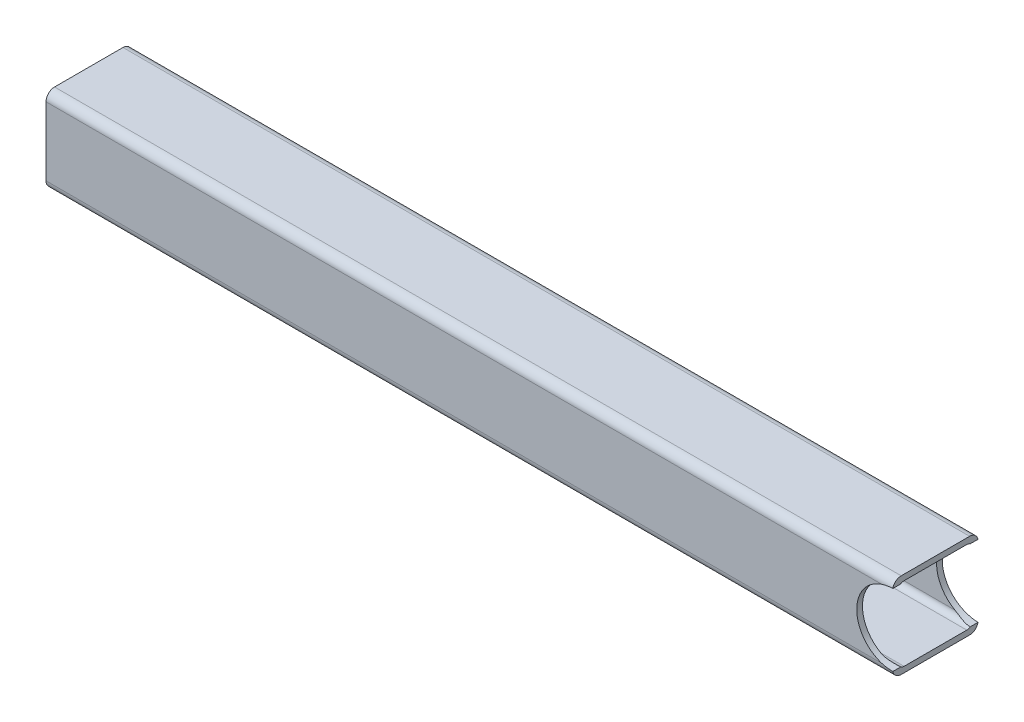
ISO-10303-21;
HEADER;
FILE_DESCRIPTION(('STEP AP214'),'2;1');
FILE_NAME('part.step','',(''),(''),'','','');
FILE_SCHEMA(('AUTOMOTIVE_DESIGN { 1 0 10303 214 1 1 1 1 }'));
ENDSEC;
DATA;
#1=APPLICATION_CONTEXT('core data for automotive mechanical design processes');
#2=APPLICATION_PROTOCOL_DEFINITION('international standard','automotive_design',2000,#1);
#3=PRODUCT_CONTEXT('',#1,'mechanical');
#4=PRODUCT('Part','Part','',(#3));
#5=PRODUCT_RELATED_PRODUCT_CATEGORY('part','',(#4));
#6=PRODUCT_DEFINITION_FORMATION('','',#4);
#7=PRODUCT_DEFINITION_CONTEXT('part definition',#1,'design');
#8=PRODUCT_DEFINITION('design','',#6,#7);
#9=PRODUCT_DEFINITION_SHAPE('','',#8);
#10=(LENGTH_UNIT() NAMED_UNIT(*) SI_UNIT(.MILLI.,.METRE.));
#11=(NAMED_UNIT(*) PLANE_ANGLE_UNIT() SI_UNIT($,.RADIAN.));
#12=(NAMED_UNIT(*) SI_UNIT($,.STERADIAN.) SOLID_ANGLE_UNIT());
#13=UNCERTAINTY_MEASURE_WITH_UNIT(LENGTH_MEASURE(1.E-05),#10,'distance_accuracy_value','');
#14=(GEOMETRIC_REPRESENTATION_CONTEXT(3) GLOBAL_UNCERTAINTY_ASSIGNED_CONTEXT((#13)) GLOBAL_UNIT_ASSIGNED_CONTEXT((#10,
#11,#12)) REPRESENTATION_CONTEXT('',''));
#15=CARTESIAN_POINT('',(0.,0.,0.));
#16=DIRECTION('',(0.,0.,1.));
#17=DIRECTION('',(1.,0.,0.));
#18=AXIS2_PLACEMENT_3D('',#15,#16,#17);
#19=CARTESIAN_POINT('',(0.,-12.,12.));
#20=DIRECTION('',(1.,0.,0.));
#21=DIRECTION('',(0.,0.,-1.));
#22=AXIS2_PLACEMENT_3D('',#19,#20,#21);
#23=PLANE('',#22);
#24=DIRECTION('',(0.,0.,1.));
#25=VECTOR('',#24,1.);
#26=CARTESIAN_POINT('',(0.,12.6,-15.));
#27=LINE('',#26,#25);
#28=CARTESIAN_POINT('',(0.,12.6,-14.9393876913398));
#29=VERTEX_POINT('',#28);
#30=CARTESIAN_POINT('',(0.,12.6,-12.2));
#31=VERTEX_POINT('',#30);
#32=EDGE_CURVE('E57',#29,#31,#27,.T.);
#33=ORIENTED_EDGE('',*,*,#32,.F.);
#34=CARTESIAN_POINT('',(0.,12.,-12.));
#35=DIRECTION('',(1.,0.,0.));
#36=DIRECTION('',(0.,0.,1.));
#37=AXIS2_PLACEMENT_3D('',#34,#35,#36);
#38=CIRCLE('',#37,3.);
#39=CARTESIAN_POINT('',(0.,15.,-12.));
#40=VERTEX_POINT('',#39);
#41=EDGE_CURVE('E196',#29,#40,#38,.T.);
#42=ORIENTED_EDGE('',*,*,#41,.T.);
#43=DIRECTION('',(0.,0.,1.));
#44=VECTOR('',#43,1.);
#45=CARTESIAN_POINT('',(0.,15.,12.));
#46=LINE('',#45,#44);
#47=CARTESIAN_POINT('',(0.,15.,12.));
#48=VERTEX_POINT('',#47);
#49=EDGE_CURVE('E241',#40,#48,#46,.T.);
#50=ORIENTED_EDGE('',*,*,#49,.T.);
#51=CARTESIAN_POINT('',(0.,12.,12.));
#52=DIRECTION('',(1.,0.,0.));
#53=DIRECTION('',(0.,0.,-1.));
#54=AXIS2_PLACEMENT_3D('',#51,#52,#53);
#55=CIRCLE('',#54,3.);
#56=CARTESIAN_POINT('',(0.,12.6,14.9393876913398));
#57=VERTEX_POINT('',#56);
#58=EDGE_CURVE('E213',#48,#57,#55,.T.);
#59=ORIENTED_EDGE('',*,*,#58,.T.);
#60=CARTESIAN_POINT('',(0.,12.6,12.2));
#61=VERTEX_POINT('',#60);
#62=EDGE_CURVE('E448',#61,#57,#27,.T.);
#63=ORIENTED_EDGE('',*,*,#62,.F.);
#64=CARTESIAN_POINT('',(0.,11.,11.));
#65=DIRECTION('',(1.,0.,0.));
#66=DIRECTION('',(0.,0.,-1.));
#67=AXIS2_PLACEMENT_3D('',#64,#65,#66);
#68=CIRCLE('',#67,2.);
#69=CARTESIAN_POINT('',(0.,13.,11.));
#70=VERTEX_POINT('',#69);
#71=EDGE_CURVE('E265',#70,#61,#68,.T.);
#72=ORIENTED_EDGE('',*,*,#71,.F.);
#73=DIRECTION('',(0.,0.,1.));
#74=VECTOR('',#73,1.);
#75=CARTESIAN_POINT('',(0.,13.,11.));
#76=LINE('',#75,#74);
#77=CARTESIAN_POINT('',(0.,13.,-11.));
#78=VERTEX_POINT('',#77);
#79=EDGE_CURVE('E285',#78,#70,#76,.T.);
#80=ORIENTED_EDGE('',*,*,#79,.F.);
#81=CARTESIAN_POINT('',(0.,11.,-11.));
#82=DIRECTION('',(1.,0.,0.));
#83=DIRECTION('',(0.,0.,1.));
#84=AXIS2_PLACEMENT_3D('',#81,#82,#83);
#85=CIRCLE('',#84,2.);
#86=EDGE_CURVE('E288',#31,#78,#85,.T.);
#87=ORIENTED_EDGE('',*,*,#86,.F.);
#88=EDGE_LOOP('',(#33,#42,#50,#59,#63,#72,#80,#87));
#89=FACE_BOUND('',#88,.T.);
#90=ADVANCED_FACE('F35',(#89),#23,.T.);
#91=CARTESIAN_POINT('',(-519.443177942439,-15.,12.));
#92=DIRECTION('',(0.,-1.,0.));
#93=DIRECTION('',(0.,0.,-1.));
#94=AXIS2_PLACEMENT_3D('',#91,#92,#93);
#95=PLANE('',#94);
#96=DIRECTION('',(0.,0.,1.));
#97=VECTOR('',#96,1.);
#98=CARTESIAN_POINT('',(-297.016771071246,-15.,12.));
#99=LINE('',#98,#97);
#100=CARTESIAN_POINT('',(-297.016771071246,-15.,-12.));
#101=VERTEX_POINT('',#100);
#102=CARTESIAN_POINT('',(-297.016771071246,-15.,12.));
#103=VERTEX_POINT('',#102);
#104=EDGE_CURVE('E50',#101,#103,#99,.T.);
#105=ORIENTED_EDGE('',*,*,#104,.F.);
#106=DIRECTION('',(1.,0.,0.));
#107=VECTOR('',#106,1.);
#108=CARTESIAN_POINT('',(-519.443177942439,-15.,-12.));
#109=LINE('',#108,#107);
#110=CARTESIAN_POINT('',(0.,-15.,-12.));
#111=VERTEX_POINT('',#110);
#112=EDGE_CURVE('E206',#101,#111,#109,.T.);
#113=ORIENTED_EDGE('',*,*,#112,.T.);
#114=DIRECTION('',(0.,0.,-1.));
#115=VECTOR('',#114,1.);
#116=CARTESIAN_POINT('',(0.,-15.,12.));
#117=LINE('',#116,#115);
#118=CARTESIAN_POINT('',(0.,-15.,12.));
#119=VERTEX_POINT('',#118);
#120=EDGE_CURVE('E256',#119,#111,#117,.T.);
#121=ORIENTED_EDGE('',*,*,#120,.F.);
#122=DIRECTION('',(1.,0.,0.));
#123=VECTOR('',#122,1.);
#124=CARTESIAN_POINT('',(-519.443177942439,-15.,12.));
#125=LINE('',#124,#123);
#126=EDGE_CURVE('E211',#103,#119,#125,.T.);
#127=ORIENTED_EDGE('',*,*,#126,.F.);
#128=EDGE_LOOP('',(#105,#113,#121,#127));
#129=FACE_BOUND('',#128,.T.);
#130=ADVANCED_FACE('F427',(#129),#95,.T.);
#131=CARTESIAN_POINT('',(-519.443177942439,-12.,-12.));
#132=DIRECTION('',(1.,0.,0.));
#133=DIRECTION('',(0.,0.,-1.));
#134=AXIS2_PLACEMENT_3D('',#131,#132,#133);
#135=CYLINDRICAL_SURFACE('',#134,3.);
#136=CARTESIAN_POINT('',(0.,-12.6,-14.9393876913398));
#137=CARTESIAN_POINT('',(-0.163187052786457,-12.6000019270772,-14.9393645936936));
#138=CARTESIAN_POINT('',(-0.326372810103336,-12.5968298384955,-14.9400340608083));
#139=CARTESIAN_POINT('',(-0.652481961012394,-12.5841519401844,-14.9425913769675));
#140=CARTESIAN_POINT('',(-0.815405365260419,-12.5746463945522,-14.9444791752089));
#141=CARTESIAN_POINT('',(-1.13977321467515,-12.5493914501626,-14.9492920323616));
#142=CARTESIAN_POINT('',(-1.30122068438478,-12.5336796401389,-14.9522108358541));
#143=CARTESIAN_POINT('',(-1.62337581019444,-12.4960374046838,-14.9587690159304));
#144=CARTESIAN_POINT('',(-1.78408345720283,-12.4741069030376,-14.9624084013452));
#145=CARTESIAN_POINT('',(-2.10451800882307,-12.4240612753338,-14.9699852069209));
#146=CARTESIAN_POINT('',(-2.26424495812741,-12.3959464332928,-14.9739226133898));
#147=CARTESIAN_POINT('',(-2.58249757231617,-12.3335720990921,-14.9815624811371));
#148=CARTESIAN_POINT('',(-2.74102325582698,-12.2993127024118,-14.9852649460652));
#149=CARTESIAN_POINT('',(-3.05760409848083,-12.2244700749938,-14.9918289754535));
#150=CARTESIAN_POINT('',(-3.21565066668061,-12.1838499831871,-14.9946853385464));
#151=CARTESIAN_POINT('',(-3.53007603864369,-12.096495385419,-14.9987616221845));
#152=CARTESIAN_POINT('',(-3.68645473241013,-12.0497604788473,-14.9999814354526));
#153=CARTESIAN_POINT('',(-3.84187454245972,-12.,-15.));
#154=B_SPLINE_CURVE_WITH_KNOTS('',3,(#136,#137,#138,#139,#140,#141,#142,#143,#144,#145,#146,
#147,#148,#149,#150,#151,#152,#153),.UNSPECIFIED.,.F.,.F.,(4,2,2,2,2,2,2,2,4),(0.,
0.489526939852249,0.97903346831559,1.46561963366495,1.95221176275915,2.43878154971315,
2.92534377658904,3.41483783773301,3.90436398399623),.UNSPECIFIED.);
#155=CARTESIAN_POINT('',(0.,-12.6,-14.9393876913398));
#156=VERTEX_POINT('',#155);
#157=CARTESIAN_POINT('',(-3.84187454245972,-12.,-15.));
#158=VERTEX_POINT('',#157);
#159=EDGE_CURVE('E181',#156,#158,#154,.T.);
#160=ORIENTED_EDGE('',*,*,#159,.F.);
#161=CARTESIAN_POINT('',(0.,-12.,-12.));
#162=DIRECTION('',(1.,0.,0.));
#163=DIRECTION('',(0.,0.,-1.));
#164=AXIS2_PLACEMENT_3D('',#161,#162,#163);
#165=CIRCLE('',#164,3.);
#166=EDGE_CURVE('E251',#111,#156,#165,.T.);
#167=ORIENTED_EDGE('',*,*,#166,.F.);
#168=ORIENTED_EDGE('',*,*,#112,.F.);
#169=CARTESIAN_POINT('',(-297.016771071246,-12.,-12.));
#170=DIRECTION('',(1.,0.,0.));
#171=DIRECTION('',(0.,1.,0.));
#172=AXIS2_PLACEMENT_3D('',#169,#170,#171);
#173=CIRCLE('',#172,3.);
#174=CARTESIAN_POINT('',(-297.016771071246,-12.,-15.));
#175=VERTEX_POINT('',#174);
#176=EDGE_CURVE('E216',#175,#101,#173,.F.);
#177=ORIENTED_EDGE('',*,*,#176,.F.);
#178=DIRECTION('',(1.,0.,0.));
#179=VECTOR('',#178,1.);
#180=CARTESIAN_POINT('',(-519.443177942439,-12.,-15.));
#181=LINE('',#180,#179);
#182=EDGE_CURVE('E202',#175,#158,#181,.T.);
#183=ORIENTED_EDGE('',*,*,#182,.T.);
#184=EDGE_LOOP('',(#160,#167,#168,#177,#183));
#185=FACE_BOUND('',#184,.T.);
#186=ADVANCED_FACE('F341',(#185),#135,.T.);
#187=CARTESIAN_POINT('',(-519.443177942439,12.,-15.));
#188=DIRECTION('',(0.,0.,-1.));
#189=DIRECTION('',(0.,1.,0.));
#190=AXIS2_PLACEMENT_3D('',#187,#188,#189);
#191=PLANE('',#190);
#192=CARTESIAN_POINT('',(0.,0.,-15.));
#193=DIRECTION('',(0.,0.,1.));
#194=DIRECTION('',(1.,0.,0.));
#195=AXIS2_PLACEMENT_3D('',#192,#193,#194);
#196=CIRCLE('',#195,12.6);
#197=CARTESIAN_POINT('',(-3.84187454245972,12.,-15.));
#198=VERTEX_POINT('',#197);
#199=EDGE_CURVE('E176',#198,#158,#196,.T.);
#200=ORIENTED_EDGE('',*,*,#199,.T.);
#201=ORIENTED_EDGE('',*,*,#182,.F.);
#202=DIRECTION('',(0.,-1.,0.));
#203=VECTOR('',#202,1.);
#204=CARTESIAN_POINT('',(-297.016771071246,12.,-15.));
#205=LINE('',#204,#203);
#206=CARTESIAN_POINT('',(-297.016771071246,12.,-15.));
#207=VERTEX_POINT('',#206);
#208=EDGE_CURVE('E200',#207,#175,#205,.T.);
#209=ORIENTED_EDGE('',*,*,#208,.F.);
#210=DIRECTION('',(1.,0.,0.));
#211=VECTOR('',#210,1.);
#212=CARTESIAN_POINT('',(-519.443177942439,12.,-15.));
#213=LINE('',#212,#211);
#214=EDGE_CURVE('E194',#207,#198,#213,.T.);
#215=ORIENTED_EDGE('',*,*,#214,.T.);
#216=EDGE_LOOP('',(#200,#201,#209,#215));
#217=FACE_BOUND('',#216,.T.);
#218=ADVANCED_FACE('F199',(#217),#191,.T.);
#219=CARTESIAN_POINT('',(-519.443177942439,12.,-12.));
#220=DIRECTION('',(1.,0.,0.));
#221=DIRECTION('',(0.,0.,-1.));
#222=AXIS2_PLACEMENT_3D('',#219,#220,#221);
#223=CYLINDRICAL_SURFACE('',#222,3.);
#224=CARTESIAN_POINT('',(-3.84187454245972,12.,-15.));
#225=CARTESIAN_POINT('',(-3.68645473241013,12.0497604788473,-14.9999814354526));
#226=CARTESIAN_POINT('',(-3.53007603864368,12.096495385419,-14.9987616221845));
#227=CARTESIAN_POINT('',(-3.21565066668061,12.1838499831871,-14.9946853385464));
#228=CARTESIAN_POINT('',(-3.05760409848083,12.2244700749938,-14.9918289754535));
#229=CARTESIAN_POINT('',(-2.74102325582698,12.2993127024118,-14.9852649460652));
#230=CARTESIAN_POINT('',(-2.58249757231617,12.3335720990921,-14.9815624811371));
#231=CARTESIAN_POINT('',(-2.26424495812741,12.3959464332928,-14.9739226133898));
#232=CARTESIAN_POINT('',(-2.10451800882306,12.4240612753338,-14.9699852069209));
#233=CARTESIAN_POINT('',(-1.78408345720283,12.4741069030376,-14.9624084013452));
#234=CARTESIAN_POINT('',(-1.62337581019444,12.4960374046838,-14.9587690159303));
#235=CARTESIAN_POINT('',(-1.30122068438478,12.5336796401389,-14.9522108358541));
#236=CARTESIAN_POINT('',(-1.13977321467515,12.5493914501626,-14.9492920323616));
#237=CARTESIAN_POINT('',(-0.815405365260419,12.5746463945522,-14.9444791752089));
#238=CARTESIAN_POINT('',(-0.652481961012394,12.5841519401844,-14.9425913769675));
#239=CARTESIAN_POINT('',(-0.326372810103336,12.5968298384955,-14.9400340608083));
#240=CARTESIAN_POINT('',(-0.163187052786456,12.6000019270772,-14.9393645936936));
#241=CARTESIAN_POINT('',(0.,12.6,-14.9393876913398));
#242=B_SPLINE_CURVE_WITH_KNOTS('',3,(#224,#225,#226,#227,#228,#229,#230,#231,#232,#233,#234,
#235,#236,#237,#238,#239,#240,#241),.UNSPECIFIED.,.F.,.F.,(4,2,2,2,2,2,2,2,4),(0.,
0.489526146263218,0.979020207407188,1.46558243428307,1.95215222123708,2.43874435033128,
2.92533051568063,3.41483704414397,3.90436398399622),.UNSPECIFIED.);
#243=EDGE_CURVE('E179',#198,#29,#242,.T.);
#244=ORIENTED_EDGE('',*,*,#243,.F.);
#245=ORIENTED_EDGE('',*,*,#214,.F.);
#246=CARTESIAN_POINT('',(-297.016771071246,12.,-12.));
#247=DIRECTION('',(1.,0.,0.));
#248=DIRECTION('',(0.,1.,0.));
#249=AXIS2_PLACEMENT_3D('',#246,#247,#248);
#250=CIRCLE('',#249,3.);
#251=CARTESIAN_POINT('',(-297.016771071246,15.,-12.));
#252=VERTEX_POINT('',#251);
#253=EDGE_CURVE('E306',#252,#207,#250,.F.);
#254=ORIENTED_EDGE('',*,*,#253,.F.);
#255=DIRECTION('',(1.,0.,0.));
#256=VECTOR('',#255,1.);
#257=CARTESIAN_POINT('',(-519.443177942439,15.,-12.));
#258=LINE('',#257,#256);
#259=EDGE_CURVE('E201',#252,#40,#258,.T.);
#260=ORIENTED_EDGE('',*,*,#259,.T.);
#261=ORIENTED_EDGE('',*,*,#41,.F.);
#262=EDGE_LOOP('',(#244,#245,#254,#260,#261));
#263=FACE_BOUND('',#262,.T.);
#264=ADVANCED_FACE('F192',(#263),#223,.T.);
#265=CARTESIAN_POINT('',(-519.443177942439,15.,12.));
#266=DIRECTION('',(0.,1.,0.));
#267=DIRECTION('',(0.,0.,1.));
#268=AXIS2_PLACEMENT_3D('',#265,#266,#267);
#269=PLANE('',#268);
#270=DIRECTION('',(0.,0.,-1.));
#271=VECTOR('',#270,1.);
#272=CARTESIAN_POINT('',(-297.016771071246,15.,12.));
#273=LINE('',#272,#271);
#274=CARTESIAN_POINT('',(-297.016771071246,15.,12.));
#275=VERTEX_POINT('',#274);
#276=EDGE_CURVE('E242',#275,#252,#273,.T.);
#277=ORIENTED_EDGE('',*,*,#276,.F.);
#278=DIRECTION('',(1.,0.,0.));
#279=VECTOR('',#278,1.);
#280=CARTESIAN_POINT('',(-519.443177942439,15.,12.));
#281=LINE('',#280,#279);
#282=EDGE_CURVE('E204',#275,#48,#281,.T.);
#283=ORIENTED_EDGE('',*,*,#282,.T.);
#284=ORIENTED_EDGE('',*,*,#49,.F.);
#285=ORIENTED_EDGE('',*,*,#259,.F.);
#286=EDGE_LOOP('',(#277,#283,#284,#285));
#287=FACE_BOUND('',#286,.T.);
#288=ADVANCED_FACE('F238',(#287),#269,.T.);
#289=CARTESIAN_POINT('',(-519.443177942439,12.,12.));
#290=DIRECTION('',(1.,0.,0.));
#291=DIRECTION('',(0.,0.,-1.));
#292=AXIS2_PLACEMENT_3D('',#289,#290,#291);
#293=CYLINDRICAL_SURFACE('',#292,3.);
#294=CARTESIAN_POINT('',(0.,12.6,14.9393876913398));
#295=CARTESIAN_POINT('',(-0.16318705278646,12.6000019270772,14.9393645936936));
#296=CARTESIAN_POINT('',(-0.326372810103342,12.5968298384955,14.9400340608083));
#297=CARTESIAN_POINT('',(-0.652481961012406,12.5841519401844,14.9425913769675));
#298=CARTESIAN_POINT('',(-0.815405365260434,12.5746463945522,14.9444791752089));
#299=CARTESIAN_POINT('',(-1.13977321467517,12.5493914501626,14.9492920323616));
#300=CARTESIAN_POINT('',(-1.30122068438481,12.5336796401389,14.9522108358541));
#301=CARTESIAN_POINT('',(-1.62337581019447,12.4960374046838,14.9587690159303));
#302=CARTESIAN_POINT('',(-1.78408345720287,12.4741069030376,14.9624084013452));
#303=CARTESIAN_POINT('',(-2.1045180088231,12.4240612753338,14.9699852069209));
#304=CARTESIAN_POINT('',(-2.26424495812745,12.3959464332928,14.9739226133898));
#305=CARTESIAN_POINT('',(-2.58249757231622,12.3335720990921,14.9815624811371));
#306=CARTESIAN_POINT('',(-2.74102325582703,12.2993127024118,14.9852649460652));
#307=CARTESIAN_POINT('',(-3.05760409848089,12.2244700749938,14.9918289754535));
#308=CARTESIAN_POINT('',(-3.21565066668067,12.1838499831871,14.9946853385464));
#309=CARTESIAN_POINT('',(-3.53007603864375,12.096495385419,14.9987616221845));
#310=CARTESIAN_POINT('',(-3.68645473241019,12.0497604788473,14.9999814354526));
#311=CARTESIAN_POINT('',(-3.84187454245979,12.,15.));
#312=B_SPLINE_CURVE_WITH_KNOTS('',3,(#294,#295,#296,#297,#298,#299,#300,#301,#302,#303,#304,
#305,#306,#307,#308,#309,#310,#311),.UNSPECIFIED.,.F.,.F.,(4,2,2,2,2,2,2,2,4),(0.,
0.489526939852259,0.979033468315608,1.46561963366497,1.95221176275918,2.4387815497132,
2.92534377658909,3.41483783773307,3.9043639839963),.UNSPECIFIED.);
#313=CARTESIAN_POINT('',(-3.84187454245979,12.,15.));
#314=VERTEX_POINT('',#313);
#315=EDGE_CURVE('E248',#57,#314,#312,.T.);
#316=ORIENTED_EDGE('',*,*,#315,.F.);
#317=ORIENTED_EDGE('',*,*,#58,.F.);
#318=ORIENTED_EDGE('',*,*,#282,.F.);
#319=CARTESIAN_POINT('',(-297.016771071246,12.,12.));
#320=DIRECTION('',(1.,0.,0.));
#321=DIRECTION('',(0.,1.,0.));
#322=AXIS2_PLACEMENT_3D('',#319,#320,#321);
#323=CIRCLE('',#322,3.);
#324=CARTESIAN_POINT('',(-297.016771071246,12.,15.));
#325=VERTEX_POINT('',#324);
#326=EDGE_CURVE('E303',#325,#275,#323,.F.);
#327=ORIENTED_EDGE('',*,*,#326,.F.);
#328=DIRECTION('',(1.,0.,0.));
#329=VECTOR('',#328,1.);
#330=CARTESIAN_POINT('',(-519.443177942439,12.,15.));
#331=LINE('',#330,#329);
#332=EDGE_CURVE('E223',#325,#314,#331,.T.);
#333=ORIENTED_EDGE('',*,*,#332,.T.);
#334=EDGE_LOOP('',(#316,#317,#318,#327,#333));
#335=FACE_BOUND('',#334,.T.);
#336=ADVANCED_FACE('F247',(#335),#293,.T.);
#337=CARTESIAN_POINT('',(-519.443177942439,12.,15.));
#338=DIRECTION('',(0.,0.,1.));
#339=DIRECTION('',(1.,0.,0.));
#340=AXIS2_PLACEMENT_3D('',#337,#338,#339);
#341=PLANE('',#340);
#342=CARTESIAN_POINT('',(0.,0.,15.));
#343=DIRECTION('',(0.,0.,1.));
#344=DIRECTION('',(1.,0.,0.));
#345=AXIS2_PLACEMENT_3D('',#342,#343,#344);
#346=CIRCLE('',#345,12.6);
#347=CARTESIAN_POINT('',(-3.84187454245972,-12.,15.));
#348=VERTEX_POINT('',#347);
#349=EDGE_CURVE('E187',#314,#348,#346,.T.);
#350=ORIENTED_EDGE('',*,*,#349,.F.);
#351=ORIENTED_EDGE('',*,*,#332,.F.);
#352=DIRECTION('',(0.,1.,0.));
#353=VECTOR('',#352,1.);
#354=CARTESIAN_POINT('',(-297.016771071246,11.9999999999999,15.));
#355=LINE('',#354,#353);
#356=CARTESIAN_POINT('',(-297.016771071246,-12.,15.));
#357=VERTEX_POINT('',#356);
#358=EDGE_CURVE('E301',#357,#325,#355,.T.);
#359=ORIENTED_EDGE('',*,*,#358,.F.);
#360=DIRECTION('',(1.,0.,0.));
#361=VECTOR('',#360,1.);
#362=CARTESIAN_POINT('',(-519.443177942439,-12.,15.));
#363=LINE('',#362,#361);
#364=EDGE_CURVE('E217',#357,#348,#363,.T.);
#365=ORIENTED_EDGE('',*,*,#364,.T.);
#366=EDGE_LOOP('',(#350,#351,#359,#365));
#367=FACE_BOUND('',#366,.T.);
#368=ADVANCED_FACE('F415',(#367),#341,.T.);
#369=CARTESIAN_POINT('',(-519.443177942439,-12.,12.));
#370=DIRECTION('',(1.,0.,0.));
#371=DIRECTION('',(0.,0.,-1.));
#372=AXIS2_PLACEMENT_3D('',#369,#370,#371);
#373=CYLINDRICAL_SURFACE('',#372,3.);
#374=CARTESIAN_POINT('',(-3.84187454245972,-12.,15.));
#375=CARTESIAN_POINT('',(-3.68645473241013,-12.0497604788473,14.9999814354526));
#376=CARTESIAN_POINT('',(-3.53007603864368,-12.096495385419,14.9987616221845));
#377=CARTESIAN_POINT('',(-3.21565066668061,-12.1838499831871,14.9946853385464));
#378=CARTESIAN_POINT('',(-3.05760409848083,-12.2244700749938,14.9918289754535));
#379=CARTESIAN_POINT('',(-2.74102325582698,-12.2993127024118,14.9852649460652));
#380=CARTESIAN_POINT('',(-2.58249757231617,-12.3335720990921,14.9815624811371));
#381=CARTESIAN_POINT('',(-2.26424495812741,-12.3959464332928,14.9739226133898));
#382=CARTESIAN_POINT('',(-2.10451800882306,-12.4240612753338,14.9699852069209));
#383=CARTESIAN_POINT('',(-1.78408345720283,-12.4741069030376,14.9624084013452));
#384=CARTESIAN_POINT('',(-1.62337581019444,-12.4960374046838,14.9587690159303));
#385=CARTESIAN_POINT('',(-1.30122068438478,-12.5336796401389,14.9522108358541));
#386=CARTESIAN_POINT('',(-1.13977321467515,-12.5493914501626,14.9492920323616));
#387=CARTESIAN_POINT('',(-0.815405365260419,-12.5746463945522,14.9444791752089));
#388=CARTESIAN_POINT('',(-0.652481961012394,-12.5841519401844,14.9425913769675));
#389=CARTESIAN_POINT('',(-0.326372810103336,-12.5968298384955,14.9400340608083));
#390=CARTESIAN_POINT('',(-0.163187052786456,-12.6000019270772,14.9393645936936));
#391=CARTESIAN_POINT('',(0.,-12.6,14.9393876913398));
#392=B_SPLINE_CURVE_WITH_KNOTS('',3,(#374,#375,#376,#377,#378,#379,#380,#381,#382,#383,#384,
#385,#386,#387,#388,#389,#390,#391),.UNSPECIFIED.,.F.,.F.,(4,2,2,2,2,2,2,2,4),(0.,
0.489526146263218,0.979020207407188,1.46558243428307,1.95215222123708,2.43874435033128,
2.92533051568063,3.41483704414397,3.90436398399622),.UNSPECIFIED.);
#393=CARTESIAN_POINT('',(0.,-12.6,14.9393876913398));
#394=VERTEX_POINT('',#393);
#395=EDGE_CURVE('E365',#348,#394,#392,.T.);
#396=ORIENTED_EDGE('',*,*,#395,.F.);
#397=ORIENTED_EDGE('',*,*,#364,.F.);
#398=CARTESIAN_POINT('',(-297.016771071246,-12.,12.));
#399=DIRECTION('',(1.,0.,0.));
#400=DIRECTION('',(0.,1.,0.));
#401=AXIS2_PLACEMENT_3D('',#398,#399,#400);
#402=CIRCLE('',#401,3.);
#403=EDGE_CURVE('E298',#103,#357,#402,.F.);
#404=ORIENTED_EDGE('',*,*,#403,.F.);
#405=ORIENTED_EDGE('',*,*,#126,.T.);
#406=CARTESIAN_POINT('',(0.,-12.,12.));
#407=DIRECTION('',(1.,0.,0.));
#408=DIRECTION('',(0.,0.,-1.));
#409=AXIS2_PLACEMENT_3D('',#406,#407,#408);
#410=CIRCLE('',#409,3.);
#411=EDGE_CURVE('E259',#394,#119,#410,.T.);
#412=ORIENTED_EDGE('',*,*,#411,.F.);
#413=EDGE_LOOP('',(#396,#397,#404,#405,#412));
#414=FACE_BOUND('',#413,.T.);
#415=ADVANCED_FACE('F37',(#414),#373,.T.);
#416=DIRECTION('',(0.,0.,1.));
#417=VECTOR('',#416,1.);
#418=CARTESIAN_POINT('',(0.,-12.6,-15.));
#419=LINE('',#418,#417);
#420=CARTESIAN_POINT('',(0.,-12.6,12.2));
#421=VERTEX_POINT('',#420);
#422=EDGE_CURVE('E65',#394,#421,#419,.F.);
#423=ORIENTED_EDGE('',*,*,#422,.F.);
#424=ORIENTED_EDGE('',*,*,#411,.T.);
#425=ORIENTED_EDGE('',*,*,#120,.T.);
#426=ORIENTED_EDGE('',*,*,#166,.T.);
#427=CARTESIAN_POINT('',(0.,-12.6,-12.2));
#428=VERTEX_POINT('',#427);
#429=EDGE_CURVE('E394',#428,#156,#419,.F.);
#430=ORIENTED_EDGE('',*,*,#429,.F.);
#431=CARTESIAN_POINT('',(0.,-11.,-11.));
#432=DIRECTION('',(1.,0.,0.));
#433=DIRECTION('',(0.,0.,-1.));
#434=AXIS2_PLACEMENT_3D('',#431,#432,#433);
#435=CIRCLE('',#434,2.);
#436=CARTESIAN_POINT('',(0.,-13.,-11.));
#437=VERTEX_POINT('',#436);
#438=EDGE_CURVE('E290',#437,#428,#435,.T.);
#439=ORIENTED_EDGE('',*,*,#438,.F.);
#440=DIRECTION('',(0.,0.,-1.));
#441=VECTOR('',#440,1.);
#442=CARTESIAN_POINT('',(0.,-13.,11.));
#443=LINE('',#442,#441);
#444=CARTESIAN_POINT('',(0.,-13.,11.));
#445=VERTEX_POINT('',#444);
#446=EDGE_CURVE('E293',#445,#437,#443,.T.);
#447=ORIENTED_EDGE('',*,*,#446,.F.);
#448=CARTESIAN_POINT('',(0.,-11.,11.));
#449=DIRECTION('',(1.,0.,0.));
#450=DIRECTION('',(0.,0.,-1.));
#451=AXIS2_PLACEMENT_3D('',#448,#449,#450);
#452=CIRCLE('',#451,2.);
#453=EDGE_CURVE('E296',#421,#445,#452,.T.);
#454=ORIENTED_EDGE('',*,*,#453,.F.);
#455=EDGE_LOOP('',(#423,#424,#425,#426,#430,#439,#447,#454));
#456=FACE_BOUND('',#455,.T.);
#457=ADVANCED_FACE('F405',(#456),#23,.T.);
#458=CARTESIAN_POINT('',(-519.443177942439,-13.,11.));
#459=DIRECTION('',(0.,-1.,0.));
#460=DIRECTION('',(0.,0.,-1.));
#461=AXIS2_PLACEMENT_3D('',#458,#459,#460);
#462=PLANE('',#461);
#463=DIRECTION('',(1.,0.,0.));
#464=VECTOR('',#463,1.);
#465=CARTESIAN_POINT('',(-519.443177942439,-13.,-11.));
#466=LINE('',#465,#464);
#467=CARTESIAN_POINT('',(-297.016771071246,-13.,-11.));
#468=VERTEX_POINT('',#467);
#469=EDGE_CURVE('E264',#468,#437,#466,.T.);
#470=ORIENTED_EDGE('',*,*,#469,.F.);
#471=DIRECTION('',(0.,0.,1.));
#472=VECTOR('',#471,1.);
#473=CARTESIAN_POINT('',(-297.016771071246,-13.,11.));
#474=LINE('',#473,#472);
#475=CARTESIAN_POINT('',(-297.016771071246,-13.,11.));
#476=VERTEX_POINT('',#475);
#477=EDGE_CURVE('E214',#468,#476,#474,.T.);
#478=ORIENTED_EDGE('',*,*,#477,.T.);
#479=DIRECTION('',(1.,0.,0.));
#480=VECTOR('',#479,1.);
#481=CARTESIAN_POINT('',(-519.443177942439,-13.,11.));
#482=LINE('',#481,#480);
#483=EDGE_CURVE('E262',#476,#445,#482,.T.);
#484=ORIENTED_EDGE('',*,*,#483,.T.);
#485=ORIENTED_EDGE('',*,*,#446,.T.);
#486=EDGE_LOOP('',(#470,#478,#484,#485));
#487=FACE_BOUND('',#486,.T.);
#488=ADVANCED_FACE('F402',(#487),#462,.F.);
#489=CARTESIAN_POINT('',(-519.443177942439,-11.,-11.));
#490=DIRECTION('',(1.,0.,0.));
#491=DIRECTION('',(0.,0.,-1.));
#492=AXIS2_PLACEMENT_3D('',#489,#490,#491);
#493=CYLINDRICAL_SURFACE('',#492,2.);
#494=ORIENTED_EDGE('',*,*,#438,.T.);
#495=CARTESIAN_POINT('',(0.,-12.6,-12.2));
#496=CARTESIAN_POINT('',(-0.125400705305915,-12.6000040461488,-12.199947715062));
#497=CARTESIAN_POINT('',(-0.250785644850239,-12.5981281308961,-12.2024955002329));
#498=CARTESIAN_POINT('',(-0.501196090277233,-12.5906495984964,-12.212395090235));
#499=CARTESIAN_POINT('',(-0.626221740772476,-12.585048785808,-12.219744568943));
#500=CARTESIAN_POINT('',(-0.875302201245896,-12.5701778272384,-12.2388210871037));
#501=CARTESIAN_POINT('',(-0.999358845891555,-12.5609196662994,-12.2505338213168));
#502=CARTESIAN_POINT('',(-1.24674438291303,-12.5387819312432,-12.2776770098024));
#503=CARTESIAN_POINT('',(-1.37007318593218,-12.5259019215433,-12.2931079112096));
#504=CARTESIAN_POINT('',(-1.73515257140323,-12.4823367846274,-12.3433604287919));
#505=CARTESIAN_POINT('',(-1.97570978035545,-12.4465008278324,-12.3824701456616));
#506=CARTESIAN_POINT('',(-2.45357129602034,-12.3611888930844,-12.4665434418931));
#507=CARTESIAN_POINT('',(-2.69087146264598,-12.3116969879822,-12.5115138241248));
#508=CARTESIAN_POINT('',(-3.20258289207218,-12.189505649504,-12.6100466564569));
#509=CARTESIAN_POINT('',(-3.47636513659859,-12.114279825886,-12.663757798972));
#510=CARTESIAN_POINT('',(-4.01900037164665,-11.9452192562696,-12.7653038063647));
#511=CARTESIAN_POINT('',(-4.28785816222533,-11.8514038147976,-12.8131446845025));
#512=CARTESIAN_POINT('',(-4.68966380201163,-11.6956492234808,-12.8759755410856));
#513=CARTESIAN_POINT('',(-4.8246000899948,-11.6406415152455,-12.8955698475574));
#514=CARTESIAN_POINT('',(-5.09292333744015,-11.5257723001631,-12.9305873386012));
#515=CARTESIAN_POINT('',(-5.2263105834087,-11.4659117077802,-12.9460113066563));
#516=CARTESIAN_POINT('',(-5.49177500389458,-11.3411626659093,-12.9717215926506));
#517=CARTESIAN_POINT('',(-5.62384645890204,-11.2762583957041,-12.981990923278));
#518=CARTESIAN_POINT('',(-5.88599050072059,-11.1416731152854,-12.9961158138897));
#519=CARTESIAN_POINT('',(-6.01606160075885,-11.0719887441639,-12.9999668119824));
#520=CARTESIAN_POINT('',(-6.14491659829492,-11.,-13.));
#521=B_SPLINE_CURVE_WITH_KNOTS('',3,(#495,#496,#497,#498,#499,#500,#501,#502,#503,#504,#505,
#506,#507,#508,#509,#510,#511,#512,#513,#514,#515,#516,#517,#518,#519,#520),.UNSPECIFIED.,.F.,
.F.,(4,2,2,2,2,2,2,2,2,2,2,2,4),(0.,0.376136773947433,0.752091467904377,1.12682426338542,
1.50160214551183,2.23998412389244,2.97923095586661,3.84549259357423,4.71085932590255,
5.15182579641585,5.59270936470369,6.03503649642386,6.47767788254574),.UNSPECIFIED.);
#522=CARTESIAN_POINT('',(-6.14491659829492,-11.,-13.));
#523=VERTEX_POINT('',#522);
#524=EDGE_CURVE('E387',#428,#523,#521,.T.);
#525=ORIENTED_EDGE('',*,*,#524,.T.);
#526=DIRECTION('',(1.,0.,0.));
#527=VECTOR('',#526,1.);
#528=CARTESIAN_POINT('',(-519.443177942439,-11.,-13.));
#529=LINE('',#528,#527);
#530=CARTESIAN_POINT('',(-297.016771071246,-11.,-13.));
#531=VERTEX_POINT('',#530);
#532=EDGE_CURVE('E267',#531,#523,#529,.T.);
#533=ORIENTED_EDGE('',*,*,#532,.F.);
#534=CARTESIAN_POINT('',(-297.016771071246,-11.,-11.));
#535=DIRECTION('',(1.,0.,0.));
#536=DIRECTION('',(0.,1.,0.));
#537=AXIS2_PLACEMENT_3D('',#534,#535,#536);
#538=CIRCLE('',#537,2.);
#539=EDGE_CURVE('E310',#531,#468,#538,.F.);
#540=ORIENTED_EDGE('',*,*,#539,.T.);
#541=ORIENTED_EDGE('',*,*,#469,.T.);
#542=EDGE_LOOP('',(#494,#525,#533,#540,#541));
#543=FACE_BOUND('',#542,.T.);
#544=ADVANCED_FACE('F396',(#543),#493,.F.);
#545=CARTESIAN_POINT('',(-519.443177942439,11.,-13.));
#546=DIRECTION('',(0.,0.,-1.));
#547=DIRECTION('',(-1.,0.,0.));
#548=AXIS2_PLACEMENT_3D('',#545,#546,#547);
#549=PLANE('',#548);
#550=ORIENTED_EDGE('',*,*,#532,.T.);
#551=CARTESIAN_POINT('',(0.,0.,-13.));
#552=DIRECTION('',(0.,0.,-1.));
#553=DIRECTION('',(-1.,0.,0.));
#554=AXIS2_PLACEMENT_3D('',#551,#552,#553);
#555=CIRCLE('',#554,12.6);
#556=CARTESIAN_POINT('',(-6.14491659829492,11.,-13.));
#557=VERTEX_POINT('',#556);
#558=EDGE_CURVE('E395',#523,#557,#555,.T.);
#559=ORIENTED_EDGE('',*,*,#558,.T.);
#560=DIRECTION('',(1.,0.,0.));
#561=VECTOR('',#560,1.);
#562=CARTESIAN_POINT('',(-519.443177942439,11.,-13.));
#563=LINE('',#562,#561);
#564=CARTESIAN_POINT('',(-297.016771071246,11.,-13.));
#565=VERTEX_POINT('',#564);
#566=EDGE_CURVE('E270',#565,#557,#563,.T.);
#567=ORIENTED_EDGE('',*,*,#566,.F.);
#568=DIRECTION('',(0.,-1.,0.));
#569=VECTOR('',#568,1.);
#570=CARTESIAN_POINT('',(-297.016771071246,11.,-13.));
#571=LINE('',#570,#569);
#572=EDGE_CURVE('E325',#565,#531,#571,.T.);
#573=ORIENTED_EDGE('',*,*,#572,.T.);
#574=EDGE_LOOP('',(#550,#559,#567,#573));
#575=FACE_BOUND('',#574,.T.);
#576=ADVANCED_FACE('F401',(#575),#549,.F.);
#577=CARTESIAN_POINT('',(-519.443177942439,11.,-11.));
#578=DIRECTION('',(1.,0.,0.));
#579=DIRECTION('',(0.,0.,-1.));
#580=AXIS2_PLACEMENT_3D('',#577,#578,#579);
#581=CYLINDRICAL_SURFACE('',#580,2.);
#582=ORIENTED_EDGE('',*,*,#566,.T.);
#583=CARTESIAN_POINT('',(-6.14491659829492,11.,-13.));
#584=CARTESIAN_POINT('',(-6.03318159588764,11.0624225027783,-12.9999805524814));
#585=CARTESIAN_POINT('',(-5.92052421629668,11.1231184345262,-12.9970788162648));
#586=CARTESIAN_POINT('',(-5.69365455435612,11.240934228458,-12.9863199387693));
#587=CARTESIAN_POINT('',(-5.57944308865295,11.2980558867433,-12.9784653087026));
#588=CARTESIAN_POINT('',(-5.34995170327536,11.4085142979775,-12.9586349726133));
#589=CARTESIAN_POINT('',(-5.23467550174135,11.4618608552249,-12.9466704525178));
#590=CARTESIAN_POINT('',(-5.002899370372,11.5649074968127,-12.9193024847867));
#591=CARTESIAN_POINT('',(-4.88639927550788,11.6146070819927,-12.9038985675635));
#592=CARTESIAN_POINT('',(-4.53899214668191,11.7566781888173,-12.8540253633499));
#593=CARTESIAN_POINT('',(-4.30649240429689,11.8437913438844,-12.8155336536638));
#594=CARTESIAN_POINT('',(-3.83762761742409,12.0039194311614,-12.7321366930146));
#595=CARTESIAN_POINT('',(-3.60125881707061,12.0769196600891,-12.6872248371501));
#596=CARTESIAN_POINT('',(-3.09404596057608,12.2173991423934,-12.5893899005698));
#597=CARTESIAN_POINT('',(-2.82271168454809,12.2829297541937,-12.5361839541194));
#598=CARTESIAN_POINT('',(-2.41248180555398,12.3676751807441,-12.459767133023));
#599=CARTESIAN_POINT('',(-2.275266149848,12.3936561438326,-12.4348711924563));
#600=CARTESIAN_POINT('',(-1.99966844487825,12.4410964059962,-12.3872163302697));
#601=CARTESIAN_POINT('',(-1.86128634285432,12.4625554993864,-12.3644575058863));
#602=CARTESIAN_POINT('',(-1.58095610597641,12.5012377396682,-12.3217907990196));
#603=CARTESIAN_POINT('',(-1.43898798608945,12.5183800260183,-12.3019398946704));
#604=CARTESIAN_POINT('',(-1.154014984544,12.5478589338965,-12.2667521149204));
#605=CARTESIAN_POINT('',(-1.01101030957413,12.5601964880178,-12.2514143636629));
#606=CARTESIAN_POINT('',(-0.723625862960536,12.5800309884786,-12.2262804180556));
#607=CARTESIAN_POINT('',(-0.579242966517934,12.5875099379253,-12.2165048431223));
#608=CARTESIAN_POINT('',(-0.362279004737257,12.5949989804407,-12.2066455278781));
#609=CARTESIAN_POINT('',(-0.289862494307675,12.5968737672457,-12.2041597307565));
#610=CARTESIAN_POINT('',(-0.144965393919274,12.5993744595794,-12.2008345054871));
#611=CARTESIAN_POINT('',(-0.0724847999586812,12.6000002806538,-12.1999951886731));
#612=CARTESIAN_POINT('',(0.,12.6,-12.2));
#613=B_SPLINE_CURVE_WITH_KNOTS('',3,(#583,#584,#585,#586,#587,#588,#589,#590,#591,#592,#593,
#594,#595,#596,#597,#598,#599,#600,#601,#602,#603,#604,#605,#606,#607,#608,#609,#610,#611,#612),
.UNSPECIFIED.,.F.,.F.,(4,2,2,2,2,2,2,2,2,2,2,2,2,2,4),(0.,0.383867930208462,0.76754138834466,
1.15017876579654,1.5328684174527,2.28596660762263,3.03984521981042,3.89164220348304,
4.31713806187796,4.74265327050115,5.17562861381036,5.60851987515132,6.04300561384927,
6.26042973841698,6.47786856455222),.UNSPECIFIED.);
#614=EDGE_CURVE('E380',#557,#31,#613,.T.);
#615=ORIENTED_EDGE('',*,*,#614,.T.);
#616=ORIENTED_EDGE('',*,*,#86,.T.);
#617=DIRECTION('',(1.,0.,0.));
#618=VECTOR('',#617,1.);
#619=CARTESIAN_POINT('',(-519.443177942439,13.,-11.));
#620=LINE('',#619,#618);
#621=CARTESIAN_POINT('',(-297.016771071246,13.,-11.));
#622=VERTEX_POINT('',#621);
#623=EDGE_CURVE('E273',#622,#78,#620,.T.);
#624=ORIENTED_EDGE('',*,*,#623,.F.);
#625=CARTESIAN_POINT('',(-297.016771071246,11.,-11.));
#626=DIRECTION('',(1.,0.,0.));
#627=DIRECTION('',(0.,1.,0.));
#628=AXIS2_PLACEMENT_3D('',#625,#626,#627);
#629=CIRCLE('',#628,2.);
#630=EDGE_CURVE('E322',#622,#565,#629,.F.);
#631=ORIENTED_EDGE('',*,*,#630,.T.);
#632=EDGE_LOOP('',(#582,#615,#616,#624,#631));
#633=FACE_BOUND('',#632,.T.);
#634=ADVANCED_FACE('F473',(#633),#581,.F.);
#635=CARTESIAN_POINT('',(-519.443177942439,13.,11.));
#636=DIRECTION('',(0.,1.,0.));
#637=DIRECTION('',(0.,0.,1.));
#638=AXIS2_PLACEMENT_3D('',#635,#636,#637);
#639=PLANE('',#638);
#640=DIRECTION('',(1.,0.,0.));
#641=VECTOR('',#640,1.);
#642=CARTESIAN_POINT('',(-519.443177942439,13.,11.));
#643=LINE('',#642,#641);
#644=CARTESIAN_POINT('',(-297.016771071246,13.,11.));
#645=VERTEX_POINT('',#644);
#646=EDGE_CURVE('E276',#645,#70,#643,.T.);
#647=ORIENTED_EDGE('',*,*,#646,.F.);
#648=DIRECTION('',(0.,0.,-1.));
#649=VECTOR('',#648,1.);
#650=CARTESIAN_POINT('',(-297.016771071246,13.,11.));
#651=LINE('',#650,#649);
#652=EDGE_CURVE('E319',#645,#622,#651,.T.);
#653=ORIENTED_EDGE('',*,*,#652,.T.);
#654=ORIENTED_EDGE('',*,*,#623,.T.);
#655=ORIENTED_EDGE('',*,*,#79,.T.);
#656=EDGE_LOOP('',(#647,#653,#654,#655));
#657=FACE_BOUND('',#656,.T.);
#658=ADVANCED_FACE('F470',(#657),#639,.F.);
#659=CARTESIAN_POINT('',(-519.443177942439,11.,11.));
#660=DIRECTION('',(1.,0.,0.));
#661=DIRECTION('',(0.,0.,-1.));
#662=AXIS2_PLACEMENT_3D('',#659,#660,#661);
#663=CYLINDRICAL_SURFACE('',#662,2.);
#664=ORIENTED_EDGE('',*,*,#71,.T.);
#665=CARTESIAN_POINT('',(0.,12.6,12.2));
#666=CARTESIAN_POINT('',(-0.125400705305916,12.6000040461488,12.199947715062));
#667=CARTESIAN_POINT('',(-0.250785644850239,12.5981281308961,12.2024955002329));
#668=CARTESIAN_POINT('',(-0.501196090277233,12.5906495984964,12.2123950902349));
#669=CARTESIAN_POINT('',(-0.626221740772476,12.585048785808,12.219744568943));
#670=CARTESIAN_POINT('',(-0.875302201245896,12.5701778272384,12.2388210871037));
#671=CARTESIAN_POINT('',(-0.999358845891555,12.5609196662994,12.2505338213168));
#672=CARTESIAN_POINT('',(-1.24674438291303,12.5387819312432,12.2776770098024));
#673=CARTESIAN_POINT('',(-1.37007318593218,12.5259019215433,12.2931079112096));
#674=CARTESIAN_POINT('',(-1.73515257140323,12.4823367846274,12.3433604287919));
#675=CARTESIAN_POINT('',(-1.97570978035545,12.4465008278324,12.3824701456616));
#676=CARTESIAN_POINT('',(-2.45357129602034,12.3611888930844,12.4665434418931));
#677=CARTESIAN_POINT('',(-2.69087146264598,12.3116969879822,12.5115138241248));
#678=CARTESIAN_POINT('',(-3.20258289207218,12.189505649504,12.6100466564569));
#679=CARTESIAN_POINT('',(-3.47636513659859,12.114279825886,12.663757798972));
#680=CARTESIAN_POINT('',(-4.01900037164665,11.9452192562696,12.7653038063647));
#681=CARTESIAN_POINT('',(-4.28785816222533,11.8514038147976,12.8131446845025));
#682=CARTESIAN_POINT('',(-4.68966380201163,11.6956492234808,12.8759755410856));
#683=CARTESIAN_POINT('',(-4.8246000899948,11.6406415152455,12.8955698475574));
#684=CARTESIAN_POINT('',(-5.09292333744015,11.5257723001631,12.9305873386011));
#685=CARTESIAN_POINT('',(-5.2263105834087,11.4659117077802,12.9460113066563));
#686=CARTESIAN_POINT('',(-5.49177500389458,11.3411626659093,12.9717215926506));
#687=CARTESIAN_POINT('',(-5.62384645890204,11.2762583957041,12.981990923278));
#688=CARTESIAN_POINT('',(-5.88599050072059,11.1416731152854,12.9961158138897));
#689=CARTESIAN_POINT('',(-6.01606160075885,11.0719887441639,12.9999668119824));
#690=CARTESIAN_POINT('',(-6.14491659829492,11.,13.));
#691=B_SPLINE_CURVE_WITH_KNOTS('',3,(#665,#666,#667,#668,#669,#670,#671,#672,#673,#674,#675,
#676,#677,#678,#679,#680,#681,#682,#683,#684,#685,#686,#687,#688,#689,#690),.UNSPECIFIED.,.F.,
.F.,(4,2,2,2,2,2,2,2,2,2,2,2,4),(0.,0.376136773947433,0.752091467904377,1.12682426338542,
1.50160214551183,2.23998412389244,2.97923095586661,3.84549259357423,4.71085932590255,
5.15182579641585,5.59270936470369,6.03503649642386,6.47767788254574),.UNSPECIFIED.);
#692=CARTESIAN_POINT('',(-6.14491659829492,11.,13.));
#693=VERTEX_POINT('',#692);
#694=EDGE_CURVE('E355',#61,#693,#691,.T.);
#695=ORIENTED_EDGE('',*,*,#694,.T.);
#696=DIRECTION('',(1.,0.,0.));
#697=VECTOR('',#696,1.);
#698=CARTESIAN_POINT('',(-519.443177942439,11.,13.));
#699=LINE('',#698,#697);
#700=CARTESIAN_POINT('',(-297.016771071246,11.,13.));
#701=VERTEX_POINT('',#700);
#702=EDGE_CURVE('E278',#701,#693,#699,.T.);
#703=ORIENTED_EDGE('',*,*,#702,.F.);
#704=CARTESIAN_POINT('',(-297.016771071246,11.,11.));
#705=DIRECTION('',(1.,0.,0.));
#706=DIRECTION('',(0.,1.,0.));
#707=AXIS2_PLACEMENT_3D('',#704,#705,#706);
#708=CIRCLE('',#707,2.);
#709=EDGE_CURVE('E316',#701,#645,#708,.F.);
#710=ORIENTED_EDGE('',*,*,#709,.T.);
#711=ORIENTED_EDGE('',*,*,#646,.T.);
#712=EDGE_LOOP('',(#664,#695,#703,#710,#711));
#713=FACE_BOUND('',#712,.T.);
#714=ADVANCED_FACE('F464',(#713),#663,.F.);
#715=CARTESIAN_POINT('',(-519.443177942439,11.,13.));
#716=DIRECTION('',(0.,0.,1.));
#717=DIRECTION('',(1.,0.,0.));
#718=AXIS2_PLACEMENT_3D('',#715,#716,#717);
#719=PLANE('',#718);
#720=ORIENTED_EDGE('',*,*,#702,.T.);
#721=CARTESIAN_POINT('',(0.,0.,13.));
#722=DIRECTION('',(0.,0.,1.));
#723=DIRECTION('',(1.,0.,0.));
#724=AXIS2_PLACEMENT_3D('',#721,#722,#723);
#725=CIRCLE('',#724,12.6);
#726=CARTESIAN_POINT('',(-6.14491659829492,-11.,13.));
#727=VERTEX_POINT('',#726);
#728=EDGE_CURVE('E186',#693,#727,#725,.T.);
#729=ORIENTED_EDGE('',*,*,#728,.T.);
#730=DIRECTION('',(1.,0.,0.));
#731=VECTOR('',#730,1.);
#732=CARTESIAN_POINT('',(-519.443177942439,-11.,13.));
#733=LINE('',#732,#731);
#734=CARTESIAN_POINT('',(-297.016771071246,-11.,13.));
#735=VERTEX_POINT('',#734);
#736=EDGE_CURVE('E261',#735,#727,#733,.T.);
#737=ORIENTED_EDGE('',*,*,#736,.F.);
#738=DIRECTION('',(0.,1.,0.));
#739=VECTOR('',#738,1.);
#740=CARTESIAN_POINT('',(-297.016771071246,11.,13.));
#741=LINE('',#740,#739);
#742=EDGE_CURVE('E313',#735,#701,#741,.T.);
#743=ORIENTED_EDGE('',*,*,#742,.T.);
#744=EDGE_LOOP('',(#720,#729,#737,#743));
#745=FACE_BOUND('',#744,.T.);
#746=ADVANCED_FACE('F410',(#745),#719,.F.);
#747=CARTESIAN_POINT('',(-519.443177942439,-11.,11.));
#748=DIRECTION('',(1.,0.,0.));
#749=DIRECTION('',(0.,0.,-1.));
#750=AXIS2_PLACEMENT_3D('',#747,#748,#749);
#751=CYLINDRICAL_SURFACE('',#750,2.);
#752=ORIENTED_EDGE('',*,*,#736,.T.);
#753=CARTESIAN_POINT('',(-6.14491659829492,-11.,13.));
#754=CARTESIAN_POINT('',(-6.03318159588764,-11.0624225027783,12.9999805524814));
#755=CARTESIAN_POINT('',(-5.92052421629668,-11.1231184345262,12.9970788162648));
#756=CARTESIAN_POINT('',(-5.69365455435612,-11.240934228458,12.9863199387693));
#757=CARTESIAN_POINT('',(-5.57944308865295,-11.2980558867433,12.9784653087026));
#758=CARTESIAN_POINT('',(-5.34995170327536,-11.4085142979775,12.9586349726133));
#759=CARTESIAN_POINT('',(-5.23467550174135,-11.4618608552249,12.9466704525178));
#760=CARTESIAN_POINT('',(-5.002899370372,-11.5649074968127,12.9193024847867));
#761=CARTESIAN_POINT('',(-4.88639927550788,-11.6146070819927,12.9038985675635));
#762=CARTESIAN_POINT('',(-4.53899214668191,-11.7566781888173,12.8540253633499));
#763=CARTESIAN_POINT('',(-4.30649240429689,-11.8437913438844,12.8155336536638));
#764=CARTESIAN_POINT('',(-3.83762761742409,-12.0039194311614,12.7321366930146));
#765=CARTESIAN_POINT('',(-3.60125881707061,-12.0769196600891,12.6872248371501));
#766=CARTESIAN_POINT('',(-3.09404596057608,-12.2173991423934,12.5893899005698));
#767=CARTESIAN_POINT('',(-2.82271168454809,-12.2829297541937,12.5361839541194));
#768=CARTESIAN_POINT('',(-2.41248180555398,-12.3676751807441,12.459767133023));
#769=CARTESIAN_POINT('',(-2.275266149848,-12.3936561438326,12.4348711924563));
#770=CARTESIAN_POINT('',(-1.99966844487825,-12.4410964059962,12.3872163302697));
#771=CARTESIAN_POINT('',(-1.86128634285432,-12.4625554993864,12.3644575058863));
#772=CARTESIAN_POINT('',(-1.58095610597641,-12.5012377396682,12.3217907990196));
#773=CARTESIAN_POINT('',(-1.43898798608945,-12.5183800260183,12.3019398946704));
#774=CARTESIAN_POINT('',(-1.154014984544,-12.5478589338965,12.2667521149204));
#775=CARTESIAN_POINT('',(-1.01101030957413,-12.5601964880178,12.2514143636629));
#776=CARTESIAN_POINT('',(-0.723625862960536,-12.5800309884786,12.2262804180556));
#777=CARTESIAN_POINT('',(-0.579242966517934,-12.5875099379253,12.2165048431223));
#778=CARTESIAN_POINT('',(-0.362279004737257,-12.5949989804407,12.2066455278781));
#779=CARTESIAN_POINT('',(-0.289862494307675,-12.5968737672457,12.2041597307565));
#780=CARTESIAN_POINT('',(-0.144965393919274,-12.5993744595794,12.2008345054871));
#781=CARTESIAN_POINT('',(-0.0724847999586812,-12.6000002806538,12.1999951886731));
#782=CARTESIAN_POINT('',(0.,-12.6,12.2));
#783=B_SPLINE_CURVE_WITH_KNOTS('',3,(#753,#754,#755,#756,#757,#758,#759,#760,#761,#762,#763,
#764,#765,#766,#767,#768,#769,#770,#771,#772,#773,#774,#775,#776,#777,#778,#779,#780,#781,#782),
.UNSPECIFIED.,.F.,.F.,(4,2,2,2,2,2,2,2,2,2,2,2,2,2,4),(0.,0.383867930208463,0.76754138834466,
1.15017876579654,1.5328684174527,2.28596660762263,3.03984521981042,3.89164220348304,
4.31713806187796,4.74265327050115,5.17562861381036,5.60851987515132,6.04300561384927,
6.26042973841698,6.47786856455222),.UNSPECIFIED.);
#784=EDGE_CURVE('E11',#727,#421,#783,.T.);
#785=ORIENTED_EDGE('',*,*,#784,.T.);
#786=ORIENTED_EDGE('',*,*,#453,.T.);
#787=ORIENTED_EDGE('',*,*,#483,.F.);
#788=CARTESIAN_POINT('',(-297.016771071246,-11.,11.));
#789=DIRECTION('',(1.,0.,0.));
#790=DIRECTION('',(0.,1.,0.));
#791=AXIS2_PLACEMENT_3D('',#788,#789,#790);
#792=CIRCLE('',#791,2.);
#793=EDGE_CURVE('E300',#476,#735,#792,.F.);
#794=ORIENTED_EDGE('',*,*,#793,.T.);
#795=EDGE_LOOP('',(#752,#785,#786,#787,#794));
#796=FACE_BOUND('',#795,.T.);
#797=ADVANCED_FACE('F406',(#796),#751,.F.);
#798=CARTESIAN_POINT('',(-297.016771071246,-47.,12.));
#799=DIRECTION('',(1.,0.,0.));
#800=DIRECTION('',(0.,0.,-1.));
#801=AXIS2_PLACEMENT_3D('',#798,#799,#800);
#802=PLANE('',#801);
#803=ORIENTED_EDGE('',*,*,#403,.T.);
#804=ORIENTED_EDGE('',*,*,#358,.T.);
#805=ORIENTED_EDGE('',*,*,#326,.T.);
#806=ORIENTED_EDGE('',*,*,#276,.T.);
#807=ORIENTED_EDGE('',*,*,#253,.T.);
#808=ORIENTED_EDGE('',*,*,#208,.T.);
#809=ORIENTED_EDGE('',*,*,#176,.T.);
#810=ORIENTED_EDGE('',*,*,#104,.T.);
#811=EDGE_LOOP('',(#803,#804,#805,#806,#807,#808,#809,#810));
#812=FACE_BOUND('',#811,.T.);
#813=ORIENTED_EDGE('',*,*,#477,.F.);
#814=ORIENTED_EDGE('',*,*,#539,.F.);
#815=ORIENTED_EDGE('',*,*,#572,.F.);
#816=ORIENTED_EDGE('',*,*,#630,.F.);
#817=ORIENTED_EDGE('',*,*,#652,.F.);
#818=ORIENTED_EDGE('',*,*,#709,.F.);
#819=ORIENTED_EDGE('',*,*,#742,.F.);
#820=ORIENTED_EDGE('',*,*,#793,.F.);
#821=EDGE_LOOP('',(#813,#814,#815,#816,#817,#818,#819,#820));
#822=FACE_BOUND('',#821,.T.);
#823=ADVANCED_FACE('F348',(#812,#822),#802,.F.);
#824=CARTESIAN_POINT('',(0.,0.,-15.));
#825=DIRECTION('',(0.,0.,1.));
#826=DIRECTION('',(1.,0.,0.));
#827=AXIS2_PLACEMENT_3D('',#824,#825,#826);
#828=CYLINDRICAL_SURFACE('',#827,12.6);
#829=ORIENTED_EDGE('',*,*,#315,.T.);
#830=ORIENTED_EDGE('',*,*,#349,.T.);
#831=ORIENTED_EDGE('',*,*,#395,.T.);
#832=ORIENTED_EDGE('',*,*,#422,.T.);
#833=ORIENTED_EDGE('',*,*,#784,.F.);
#834=ORIENTED_EDGE('',*,*,#728,.F.);
#835=ORIENTED_EDGE('',*,*,#694,.F.);
#836=ORIENTED_EDGE('',*,*,#62,.T.);
#837=EDGE_LOOP('',(#829,#830,#831,#832,#833,#834,#835,#836));
#838=FACE_BOUND('',#837,.T.);
#839=ADVANCED_FACE('F344',(#838),#828,.F.);
#840=ORIENTED_EDGE('',*,*,#159,.T.);
#841=ORIENTED_EDGE('',*,*,#199,.F.);
#842=ORIENTED_EDGE('',*,*,#243,.T.);
#843=ORIENTED_EDGE('',*,*,#32,.T.);
#844=ORIENTED_EDGE('',*,*,#614,.F.);
#845=ORIENTED_EDGE('',*,*,#558,.F.);
#846=ORIENTED_EDGE('',*,*,#524,.F.);
#847=ORIENTED_EDGE('',*,*,#429,.T.);
#848=EDGE_LOOP('',(#840,#841,#842,#843,#844,#845,#846,#847));
#849=FACE_BOUND('',#848,.T.);
#850=ADVANCED_FACE('F178',(#849),#828,.F.);
#851=CLOSED_SHELL('',(#90,#130,#186,#218,#264,#288,#336,#368,#415,#457,#488,#544,#576,#634,#658,
#714,#746,#797,#823,#839,#850));
#852=MANIFOLD_SOLID_BREP('B2',#851);
#853=ADVANCED_BREP_SHAPE_REPRESENTATION('',(#18,#852),#14);
#854=SHAPE_DEFINITION_REPRESENTATION(#9,#853);
ENDSEC;
END-ISO-10303-21;
